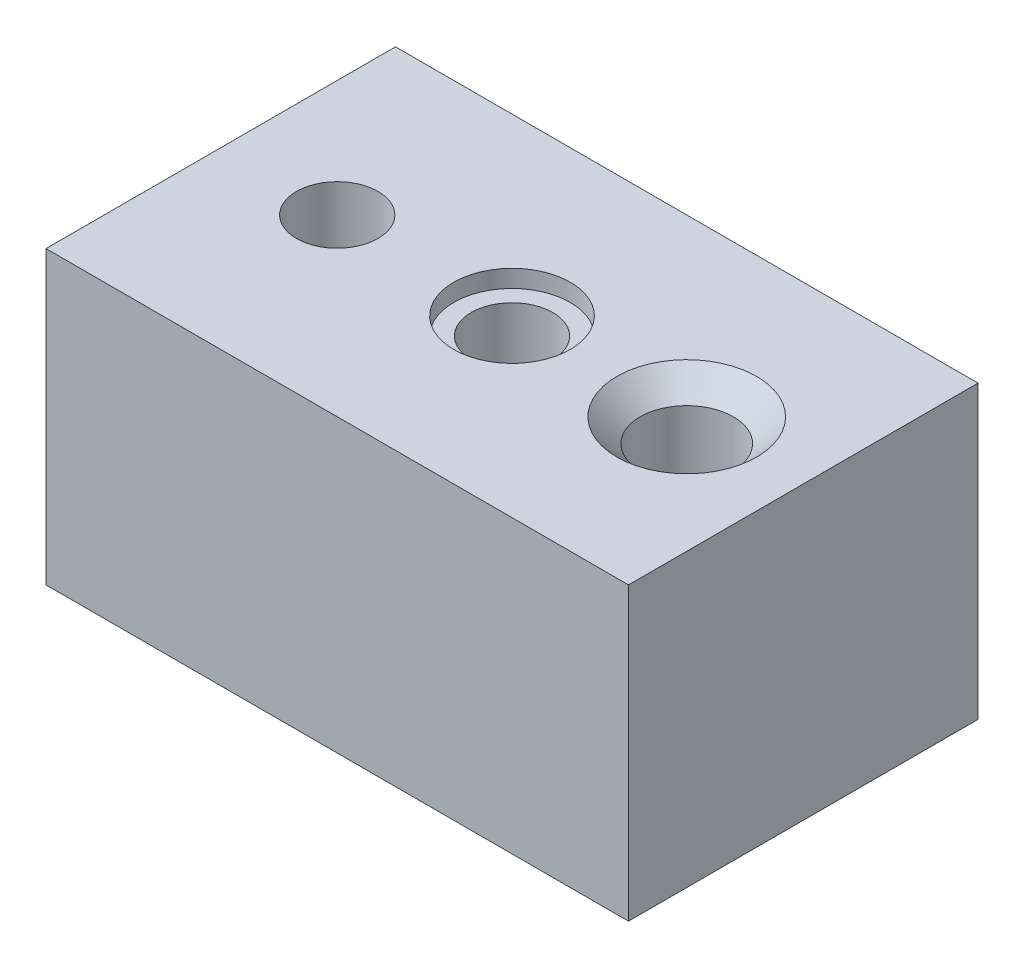
ISO-10303-21;
HEADER;
FILE_DESCRIPTION(('STEP AP214'),'2;1');
FILE_NAME('part.step','',(''),(''),'','','');
FILE_SCHEMA(('AUTOMOTIVE_DESIGN { 1 0 10303 214 1 1 1 1 }'));
ENDSEC;
DATA;
#1=APPLICATION_CONTEXT('core data for automotive mechanical design processes');
#2=APPLICATION_PROTOCOL_DEFINITION('international standard','automotive_design',2000,#1);
#3=PRODUCT_CONTEXT('',#1,'mechanical');
#4=PRODUCT('Part','Part','',(#3));
#5=PRODUCT_RELATED_PRODUCT_CATEGORY('part','',(#4));
#6=PRODUCT_DEFINITION_FORMATION('','',#4);
#7=PRODUCT_DEFINITION_CONTEXT('part definition',#1,'design');
#8=PRODUCT_DEFINITION('design','',#6,#7);
#9=PRODUCT_DEFINITION_SHAPE('','',#8);
#10=(LENGTH_UNIT() NAMED_UNIT(*) SI_UNIT(.MILLI.,.METRE.));
#11=(NAMED_UNIT(*) PLANE_ANGLE_UNIT() SI_UNIT($,.RADIAN.));
#12=(NAMED_UNIT(*) SI_UNIT($,.STERADIAN.) SOLID_ANGLE_UNIT());
#13=UNCERTAINTY_MEASURE_WITH_UNIT(LENGTH_MEASURE(1.E-05),#10,'distance_accuracy_value','');
#14=(GEOMETRIC_REPRESENTATION_CONTEXT(3) GLOBAL_UNCERTAINTY_ASSIGNED_CONTEXT((#13)) GLOBAL_UNIT_ASSIGNED_CONTEXT((#10,
#11,#12)) REPRESENTATION_CONTEXT('',''));
#15=CARTESIAN_POINT('',(0.,0.,0.));
#16=DIRECTION('',(0.,0.,1.));
#17=DIRECTION('',(1.,0.,0.));
#18=AXIS2_PLACEMENT_3D('',#15,#16,#17);
#19=CARTESIAN_POINT('',(0.,-50.,0.));
#20=DIRECTION('',(-1.,0.,0.));
#21=DIRECTION('',(0.,0.,1.));
#22=AXIS2_PLACEMENT_3D('',#19,#20,#21);
#23=PLANE('',#22);
#24=DIRECTION('',(0.,0.,1.));
#25=VECTOR('',#24,1.);
#26=CARTESIAN_POINT('',(0.,0.,0.));
#27=LINE('',#26,#25);
#28=CARTESIAN_POINT('',(0.,0.,-60.));
#29=VERTEX_POINT('',#28);
#30=CARTESIAN_POINT('',(0.,0.,0.));
#31=VERTEX_POINT('',#30);
#32=EDGE_CURVE('E141',#29,#31,#27,.T.);
#33=ORIENTED_EDGE('',*,*,#32,.F.);
#34=DIRECTION('',(0.,1.,0.));
#35=VECTOR('',#34,1.);
#36=CARTESIAN_POINT('',(0.,-50.,-60.));
#37=LINE('',#36,#35);
#38=CARTESIAN_POINT('',(0.,-50.,-60.));
#39=VERTEX_POINT('',#38);
#40=EDGE_CURVE('E11',#39,#29,#37,.T.);
#41=ORIENTED_EDGE('',*,*,#40,.F.);
#42=DIRECTION('',(0.,0.,1.));
#43=VECTOR('',#42,1.);
#44=CARTESIAN_POINT('',(0.,-50.,0.));
#45=LINE('',#44,#43);
#46=CARTESIAN_POINT('',(0.,-50.,0.));
#47=VERTEX_POINT('',#46);
#48=EDGE_CURVE('E142',#39,#47,#45,.T.);
#49=ORIENTED_EDGE('',*,*,#48,.T.);
#50=DIRECTION('',(0.,1.,0.));
#51=VECTOR('',#50,1.);
#52=CARTESIAN_POINT('',(0.,-50.,0.));
#53=LINE('',#52,#51);
#54=EDGE_CURVE('E54',#47,#31,#53,.T.);
#55=ORIENTED_EDGE('',*,*,#54,.T.);
#56=EDGE_LOOP('',(#33,#41,#49,#55));
#57=FACE_BOUND('',#56,.T.);
#58=ADVANCED_FACE('F51',(#57),#23,.T.);
#59=CARTESIAN_POINT('',(0.,-50.,-60.));
#60=DIRECTION('',(0.,0.,-1.));
#61=DIRECTION('',(-1.,0.,0.));
#62=AXIS2_PLACEMENT_3D('',#59,#60,#61);
#63=PLANE('',#62);
#64=DIRECTION('',(-1.,0.,0.));
#65=VECTOR('',#64,1.);
#66=CARTESIAN_POINT('',(0.,0.,-60.));
#67=LINE('',#66,#65);
#68=CARTESIAN_POINT('',(100.,0.,-60.));
#69=VERTEX_POINT('',#68);
#70=EDGE_CURVE('E146',#69,#29,#67,.T.);
#71=ORIENTED_EDGE('',*,*,#70,.F.);
#72=DIRECTION('',(0.,1.,0.));
#73=VECTOR('',#72,1.);
#74=CARTESIAN_POINT('',(100.,-50.,-60.));
#75=LINE('',#74,#73);
#76=CARTESIAN_POINT('',(100.,-50.,-60.));
#77=VERTEX_POINT('',#76);
#78=EDGE_CURVE('E61',#77,#69,#75,.T.);
#79=ORIENTED_EDGE('',*,*,#78,.F.);
#80=DIRECTION('',(-1.,0.,0.));
#81=VECTOR('',#80,1.);
#82=CARTESIAN_POINT('',(0.,-50.,-60.));
#83=LINE('',#82,#81);
#84=EDGE_CURVE('E152',#77,#39,#83,.T.);
#85=ORIENTED_EDGE('',*,*,#84,.T.);
#86=ORIENTED_EDGE('',*,*,#40,.T.);
#87=EDGE_LOOP('',(#71,#79,#85,#86));
#88=FACE_BOUND('',#87,.T.);
#89=ADVANCED_FACE('F179',(#88),#63,.T.);
#90=CARTESIAN_POINT('',(100.,-50.,0.));
#91=DIRECTION('',(1.,0.,0.));
#92=DIRECTION('',(0.,0.,-1.));
#93=AXIS2_PLACEMENT_3D('',#90,#91,#92);
#94=PLANE('',#93);
#95=DIRECTION('',(0.,0.,-1.));
#96=VECTOR('',#95,1.);
#97=CARTESIAN_POINT('',(100.,0.,0.));
#98=LINE('',#97,#96);
#99=CARTESIAN_POINT('',(100.,0.,0.));
#100=VERTEX_POINT('',#99);
#101=EDGE_CURVE('E162',#100,#69,#98,.T.);
#102=ORIENTED_EDGE('',*,*,#101,.F.);
#103=DIRECTION('',(0.,1.,0.));
#104=VECTOR('',#103,1.);
#105=CARTESIAN_POINT('',(100.,-50.,0.));
#106=LINE('',#105,#104);
#107=CARTESIAN_POINT('',(100.,-50.,0.));
#108=VERTEX_POINT('',#107);
#109=EDGE_CURVE('E169',#108,#100,#106,.T.);
#110=ORIENTED_EDGE('',*,*,#109,.F.);
#111=DIRECTION('',(0.,0.,-1.));
#112=VECTOR('',#111,1.);
#113=CARTESIAN_POINT('',(100.,-50.,0.));
#114=LINE('',#113,#112);
#115=EDGE_CURVE('E149',#108,#77,#114,.T.);
#116=ORIENTED_EDGE('',*,*,#115,.T.);
#117=ORIENTED_EDGE('',*,*,#78,.T.);
#118=EDGE_LOOP('',(#102,#110,#116,#117));
#119=FACE_BOUND('',#118,.T.);
#120=ADVANCED_FACE('F182',(#119),#94,.T.);
#121=CARTESIAN_POINT('',(0.,-50.,0.));
#122=DIRECTION('',(0.,0.,1.));
#123=DIRECTION('',(1.,0.,0.));
#124=AXIS2_PLACEMENT_3D('',#121,#122,#123);
#125=PLANE('',#124);
#126=DIRECTION('',(1.,0.,0.));
#127=VECTOR('',#126,1.);
#128=CARTESIAN_POINT('',(0.,0.,0.));
#129=LINE('',#128,#127);
#130=EDGE_CURVE('E158',#31,#100,#129,.T.);
#131=ORIENTED_EDGE('',*,*,#130,.F.);
#132=ORIENTED_EDGE('',*,*,#54,.F.);
#133=DIRECTION('',(1.,0.,0.));
#134=VECTOR('',#133,1.);
#135=CARTESIAN_POINT('',(0.,-50.,0.));
#136=LINE('',#135,#134);
#137=EDGE_CURVE('E145',#47,#108,#136,.T.);
#138=ORIENTED_EDGE('',*,*,#137,.T.);
#139=ORIENTED_EDGE('',*,*,#109,.T.);
#140=EDGE_LOOP('',(#131,#132,#138,#139));
#141=FACE_BOUND('',#140,.T.);
#142=ADVANCED_FACE('F176',(#141),#125,.T.);
#143=CARTESIAN_POINT('',(0.,-50.,0.));
#144=DIRECTION('',(0.,-1.,0.));
#145=DIRECTION('',(0.,0.,-1.));
#146=AXIS2_PLACEMENT_3D('',#143,#144,#145);
#147=PLANE('',#146);
#148=CARTESIAN_POINT('',(20.,-50.,-30.));
#149=DIRECTION('',(0.,1.,0.));
#150=DIRECTION('',(0.,0.,1.));
#151=AXIS2_PLACEMENT_3D('',#148,#149,#150);
#152=CIRCLE('',#151,6.99999999999999);
#153=CARTESIAN_POINT('',(20.,-50.,-23.));
#154=VERTEX_POINT('',#153);
#155=EDGE_CURVE('E343',#154,#154,#152,.T.);
#156=ORIENTED_EDGE('',*,*,#155,.T.);
#157=EDGE_LOOP('',(#156));
#158=FACE_BOUND('',#157,.T.);
#159=ORIENTED_EDGE('',*,*,#48,.F.);
#160=ORIENTED_EDGE('',*,*,#84,.F.);
#161=ORIENTED_EDGE('',*,*,#115,.F.);
#162=ORIENTED_EDGE('',*,*,#137,.F.);
#163=EDGE_LOOP('',(#159,#160,#161,#162));
#164=FACE_BOUND('',#163,.T.);
#165=ADVANCED_FACE('F184',(#158,#164),#147,.T.);
#166=CARTESIAN_POINT('',(0.,0.,0.));
#167=DIRECTION('',(0.,-1.,0.));
#168=DIRECTION('',(0.,0.,-1.));
#169=AXIS2_PLACEMENT_3D('',#166,#167,#168);
#170=PLANE('',#169);
#171=CARTESIAN_POINT('',(20.,0.,-30.));
#172=DIRECTION('',(0.,1.,0.));
#173=DIRECTION('',(0.,0.,1.));
#174=AXIS2_PLACEMENT_3D('',#171,#172,#173);
#175=CIRCLE('',#174,6.99999999999999);
#176=CARTESIAN_POINT('',(20.,0.,-23.));
#177=VERTEX_POINT('',#176);
#178=EDGE_CURVE('E346',#177,#177,#175,.T.);
#179=ORIENTED_EDGE('',*,*,#178,.F.);
#180=EDGE_LOOP('',(#179));
#181=FACE_BOUND('',#180,.T.);
#182=CARTESIAN_POINT('',(80.,0.,-30.));
#183=DIRECTION('',(0.,1.,0.));
#184=DIRECTION('',(0.,0.,1.));
#185=AXIS2_PLACEMENT_3D('',#182,#183,#184);
#186=CIRCLE('',#185,12.);
#187=CARTESIAN_POINT('',(80.,0.,-18.));
#188=VERTEX_POINT('',#187);
#189=EDGE_CURVE('E126',#188,#188,#186,.T.);
#190=ORIENTED_EDGE('',*,*,#189,.F.);
#191=EDGE_LOOP('',(#190));
#192=FACE_BOUND('',#191,.T.);
#193=CARTESIAN_POINT('',(50.,0.,-30.));
#194=DIRECTION('',(0.,1.,0.));
#195=DIRECTION('',(0.,0.,1.));
#196=AXIS2_PLACEMENT_3D('',#193,#194,#195);
#197=CIRCLE('',#196,9.99999999999999);
#198=CARTESIAN_POINT('',(50.,0.,-20.));
#199=VERTEX_POINT('',#198);
#200=EDGE_CURVE('E115',#199,#199,#197,.T.);
#201=ORIENTED_EDGE('',*,*,#200,.F.);
#202=EDGE_LOOP('',(#201));
#203=FACE_BOUND('',#202,.T.);
#204=ORIENTED_EDGE('',*,*,#32,.T.);
#205=ORIENTED_EDGE('',*,*,#130,.T.);
#206=ORIENTED_EDGE('',*,*,#101,.T.);
#207=ORIENTED_EDGE('',*,*,#70,.T.);
#208=EDGE_LOOP('',(#204,#205,#206,#207));
#209=FACE_BOUND('',#208,.T.);
#210=ADVANCED_FACE('F178',(#181,#192,#203,#209),#170,.F.);
#211=CARTESIAN_POINT('',(50.,-16.,-30.));
#212=DIRECTION('',(0.,1.,0.));
#213=DIRECTION('',(0.,0.,1.));
#214=AXIS2_PLACEMENT_3D('',#211,#212,#213);
#215=CONICAL_SURFACE('',#214,6.99999999999999,1.02974425867665);
#216=CARTESIAN_POINT('',(50.,-20.2060243331929,-30.));
#217=VERTEX_POINT('',#216);
#218=VERTEX_LOOP('',#217);
#219=FACE_BOUND('',#218,.T.);
#220=CARTESIAN_POINT('',(50.,-16.,-30.));
#221=DIRECTION('',(0.,1.,0.));
#222=DIRECTION('',(0.,0.,1.));
#223=AXIS2_PLACEMENT_3D('',#220,#221,#222);
#224=CIRCLE('',#223,6.99999999999999);
#225=CARTESIAN_POINT('',(50.,-16.,-23.));
#226=VERTEX_POINT('',#225);
#227=EDGE_CURVE('E137',#226,#226,#224,.T.);
#228=ORIENTED_EDGE('',*,*,#227,.T.);
#229=EDGE_LOOP('',(#228));
#230=FACE_BOUND('',#229,.T.);
#231=ADVANCED_FACE('F192',(#219,#230),#215,.F.);
#232=CARTESIAN_POINT('',(50.,0.,-30.));
#233=DIRECTION('',(0.,1.,0.));
#234=DIRECTION('',(0.,0.,1.));
#235=AXIS2_PLACEMENT_3D('',#232,#233,#234);
#236=CYLINDRICAL_SURFACE('',#235,7.);
#237=ORIENTED_EDGE('',*,*,#227,.F.);
#238=EDGE_LOOP('',(#237));
#239=FACE_BOUND('',#238,.T.);
#240=CARTESIAN_POINT('',(50.,-3.,-30.));
#241=DIRECTION('',(0.,1.,0.));
#242=DIRECTION('',(0.,0.,1.));
#243=AXIS2_PLACEMENT_3D('',#240,#241,#242);
#244=CIRCLE('',#243,7.);
#245=CARTESIAN_POINT('',(50.,-3.,-23.));
#246=VERTEX_POINT('',#245);
#247=EDGE_CURVE('E133',#246,#246,#244,.T.);
#248=ORIENTED_EDGE('',*,*,#247,.T.);
#249=EDGE_LOOP('',(#248));
#250=FACE_BOUND('',#249,.T.);
#251=ADVANCED_FACE('F233',(#239,#250),#236,.F.);
#252=CARTESIAN_POINT('',(57.,-3.,-30.));
#253=DIRECTION('',(0.,-1.,0.));
#254=DIRECTION('',(0.,0.,-1.));
#255=AXIS2_PLACEMENT_3D('',#252,#253,#254);
#256=PLANE('',#255);
#257=ORIENTED_EDGE('',*,*,#247,.F.);
#258=EDGE_LOOP('',(#257));
#259=FACE_BOUND('',#258,.T.);
#260=CARTESIAN_POINT('',(50.,-3.,-30.));
#261=DIRECTION('',(0.,1.,0.));
#262=DIRECTION('',(0.,0.,1.));
#263=AXIS2_PLACEMENT_3D('',#260,#261,#262);
#264=CIRCLE('',#263,9.99999999999999);
#265=CARTESIAN_POINT('',(50.,-3.,-20.));
#266=VERTEX_POINT('',#265);
#267=EDGE_CURVE('E123',#266,#266,#264,.T.);
#268=ORIENTED_EDGE('',*,*,#267,.T.);
#269=EDGE_LOOP('',(#268));
#270=FACE_BOUND('',#269,.T.);
#271=ADVANCED_FACE('F242',(#259,#270),#256,.F.);
#272=CARTESIAN_POINT('',(50.,0.,-30.));
#273=DIRECTION('',(0.,1.,0.));
#274=DIRECTION('',(0.,0.,1.));
#275=AXIS2_PLACEMENT_3D('',#272,#273,#274);
#276=CYLINDRICAL_SURFACE('',#275,9.99999999999999);
#277=ORIENTED_EDGE('',*,*,#267,.F.);
#278=EDGE_LOOP('',(#277));
#279=FACE_BOUND('',#278,.T.);
#280=ORIENTED_EDGE('',*,*,#200,.T.);
#281=EDGE_LOOP('',(#280));
#282=FACE_BOUND('',#281,.T.);
#283=ADVANCED_FACE('F108',(#279,#282),#276,.F.);
#284=CARTESIAN_POINT('',(80.,-16.,-30.));
#285=DIRECTION('',(0.,1.,0.));
#286=DIRECTION('',(0.,0.,1.));
#287=AXIS2_PLACEMENT_3D('',#284,#285,#286);
#288=CONICAL_SURFACE('',#287,7.99999999999999,1.02974425867665);
#289=CARTESIAN_POINT('',(80.,-20.8068849522205,-30.));
#290=VERTEX_POINT('',#289);
#291=VERTEX_LOOP('',#290);
#292=FACE_BOUND('',#291,.T.);
#293=CARTESIAN_POINT('',(80.,-16.,-30.));
#294=DIRECTION('',(0.,1.,0.));
#295=DIRECTION('',(0.,0.,1.));
#296=AXIS2_PLACEMENT_3D('',#293,#294,#295);
#297=CIRCLE('',#296,7.99999999999999);
#298=CARTESIAN_POINT('',(80.,-16.,-22.));
#299=VERTEX_POINT('',#298);
#300=EDGE_CURVE('E112',#299,#299,#297,.T.);
#301=ORIENTED_EDGE('',*,*,#300,.T.);
#302=EDGE_LOOP('',(#301));
#303=FACE_BOUND('',#302,.T.);
#304=ADVANCED_FACE('F104',(#292,#303),#288,.F.);
#305=CARTESIAN_POINT('',(80.,0.,-30.));
#306=DIRECTION('',(0.,1.,0.));
#307=DIRECTION('',(0.,0.,1.));
#308=AXIS2_PLACEMENT_3D('',#305,#306,#307);
#309=CYLINDRICAL_SURFACE('',#308,7.99999999999999);
#310=ORIENTED_EDGE('',*,*,#300,.F.);
#311=EDGE_LOOP('',(#310));
#312=FACE_BOUND('',#311,.T.);
#313=CARTESIAN_POINT('',(80.,-4.,-30.));
#314=DIRECTION('',(0.,1.,0.));
#315=DIRECTION('',(0.,0.,1.));
#316=AXIS2_PLACEMENT_3D('',#313,#314,#315);
#317=CIRCLE('',#316,7.99999999999999);
#318=CARTESIAN_POINT('',(80.,-4.,-22.));
#319=VERTEX_POINT('',#318);
#320=EDGE_CURVE('E116',#319,#319,#317,.T.);
#321=ORIENTED_EDGE('',*,*,#320,.T.);
#322=EDGE_LOOP('',(#321));
#323=FACE_BOUND('',#322,.T.);
#324=ADVANCED_FACE('F107',(#312,#323),#309,.F.);
#325=CARTESIAN_POINT('',(80.,0.,-30.));
#326=DIRECTION('',(0.,1.,0.));
#327=DIRECTION('',(0.,0.,1.));
#328=AXIS2_PLACEMENT_3D('',#325,#326,#327);
#329=CONICAL_SURFACE('',#328,12.,0.785398163397449);
#330=ORIENTED_EDGE('',*,*,#320,.F.);
#331=EDGE_LOOP('',(#330));
#332=FACE_BOUND('',#331,.T.);
#333=ORIENTED_EDGE('',*,*,#189,.T.);
#334=EDGE_LOOP('',(#333));
#335=FACE_BOUND('',#334,.T.);
#336=ADVANCED_FACE('F276',(#332,#335),#329,.F.);
#337=CARTESIAN_POINT('',(20.,0.,-30.));
#338=DIRECTION('',(0.,1.,0.));
#339=DIRECTION('',(0.,0.,1.));
#340=AXIS2_PLACEMENT_3D('',#337,#338,#339);
#341=CYLINDRICAL_SURFACE('',#340,6.99999999999999);
#342=ORIENTED_EDGE('',*,*,#155,.F.);
#343=EDGE_LOOP('',(#342));
#344=FACE_BOUND('',#343,.T.);
#345=ORIENTED_EDGE('',*,*,#178,.T.);
#346=EDGE_LOOP('',(#345));
#347=FACE_BOUND('',#346,.T.);
#348=ADVANCED_FACE('F284',(#344,#347),#341,.F.);
#349=CLOSED_SHELL('',(#58,#89,#120,#142,#165,#210,#231,#251,#271,#283,#304,#324,#336,#348));
#350=MANIFOLD_SOLID_BREP('B2',#349);
#351=ADVANCED_BREP_SHAPE_REPRESENTATION('',(#18,#350),#14);
#352=SHAPE_DEFINITION_REPRESENTATION(#9,#351);
ENDSEC;
END-ISO-10303-21;
